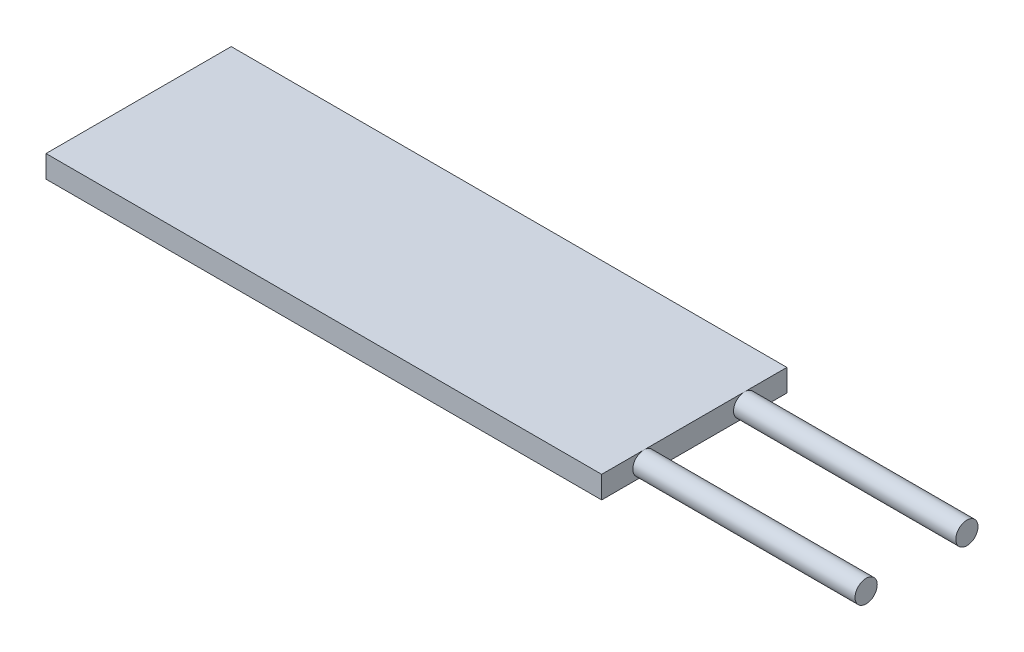
ISO-10303-21;
HEADER;
FILE_DESCRIPTION(('STEP AP214'),'2;1');
FILE_NAME('part.step','',(''),(''),'','','');
FILE_SCHEMA(('AUTOMOTIVE_DESIGN { 1 0 10303 214 1 1 1 1 }'));
ENDSEC;
DATA;
#1=APPLICATION_CONTEXT('core data for automotive mechanical design processes');
#2=APPLICATION_PROTOCOL_DEFINITION('international standard','automotive_design',2000,#1);
#3=PRODUCT_CONTEXT('',#1,'mechanical');
#4=PRODUCT('Part','Part','',(#3));
#5=PRODUCT_RELATED_PRODUCT_CATEGORY('part','',(#4));
#6=PRODUCT_DEFINITION_FORMATION('','',#4);
#7=PRODUCT_DEFINITION_CONTEXT('part definition',#1,'design');
#8=PRODUCT_DEFINITION('design','',#6,#7);
#9=PRODUCT_DEFINITION_SHAPE('','',#8);
#10=(LENGTH_UNIT() NAMED_UNIT(*) SI_UNIT(.MILLI.,.METRE.));
#11=(NAMED_UNIT(*) PLANE_ANGLE_UNIT() SI_UNIT($,.RADIAN.));
#12=(NAMED_UNIT(*) SI_UNIT($,.STERADIAN.) SOLID_ANGLE_UNIT());
#13=UNCERTAINTY_MEASURE_WITH_UNIT(LENGTH_MEASURE(1.E-05),#10,'distance_accuracy_value','');
#14=(GEOMETRIC_REPRESENTATION_CONTEXT(3) GLOBAL_UNCERTAINTY_ASSIGNED_CONTEXT((#13)) GLOBAL_UNIT_ASSIGNED_CONTEXT((#10,
#11,#12)) REPRESENTATION_CONTEXT('',''));
#15=CARTESIAN_POINT('',(0.,0.,0.));
#16=DIRECTION('',(0.,0.,1.));
#17=DIRECTION('',(1.,0.,0.));
#18=AXIS2_PLACEMENT_3D('',#15,#16,#17);
#19=CARTESIAN_POINT('',(75.,0.,0.));
#20=DIRECTION('',(-1.,0.,0.));
#21=DIRECTION('',(0.,0.,1.));
#22=AXIS2_PLACEMENT_3D('',#19,#20,#21);
#23=PLANE('',#22);
#24=CARTESIAN_POINT('',(75.,0.,-6.8));
#25=DIRECTION('',(1.,0.,0.));
#26=DIRECTION('',(0.,0.,1.));
#27=AXIS2_PLACEMENT_3D('',#24,#25,#26);
#28=CIRCLE('',#27,1.5);
#29=CARTESIAN_POINT('',(75.,-1.5,-6.8));
#30=VERTEX_POINT('',#29);
#31=CARTESIAN_POINT('',(75.,1.5,-6.8));
#32=VERTEX_POINT('',#31);
#33=EDGE_CURVE('E105',#30,#32,#28,.T.);
#34=ORIENTED_EDGE('',*,*,#33,.F.);
#35=DIRECTION('',(0.,0.,-1.));
#36=VECTOR('',#35,1.);
#37=CARTESIAN_POINT('',(75.,-1.5,12.5));
#38=LINE('',#37,#36);
#39=CARTESIAN_POINT('',(75.,-1.5,-12.5));
#40=VERTEX_POINT('',#39);
#41=EDGE_CURVE('E92',#30,#40,#38,.T.);
#42=ORIENTED_EDGE('',*,*,#41,.T.);
#43=DIRECTION('',(0.,1.,0.));
#44=VECTOR('',#43,1.);
#45=CARTESIAN_POINT('',(75.,-1.5,-12.5));
#46=LINE('',#45,#44);
#47=CARTESIAN_POINT('',(75.,1.5,-12.5));
#48=VERTEX_POINT('',#47);
#49=EDGE_CURVE('E178',#40,#48,#46,.T.);
#50=ORIENTED_EDGE('',*,*,#49,.T.);
#51=DIRECTION('',(0.,0.,1.));
#52=VECTOR('',#51,1.);
#53=CARTESIAN_POINT('',(75.,1.5,12.5));
#54=LINE('',#53,#52);
#55=EDGE_CURVE('E106',#48,#32,#54,.T.);
#56=ORIENTED_EDGE('',*,*,#55,.T.);
#57=EDGE_LOOP('',(#34,#42,#50,#56));
#58=FACE_BOUND('',#57,.T.);
#59=ADVANCED_FACE('F39',(#58),#23,.F.);
#60=CARTESIAN_POINT('',(75.,0.,6.8));
#61=DIRECTION('',(1.,0.,0.));
#62=DIRECTION('',(0.,0.,-1.));
#63=AXIS2_PLACEMENT_3D('',#60,#61,#62);
#64=CIRCLE('',#63,1.5);
#65=CARTESIAN_POINT('',(75.,1.5,6.8));
#66=VERTEX_POINT('',#65);
#67=CARTESIAN_POINT('',(75.,-1.5,6.8));
#68=VERTEX_POINT('',#67);
#69=EDGE_CURVE('E184',#66,#68,#64,.T.);
#70=ORIENTED_EDGE('',*,*,#69,.F.);
#71=CARTESIAN_POINT('',(75.,1.5,12.5));
#72=VERTEX_POINT('',#71);
#73=EDGE_CURVE('E198',#66,#72,#54,.T.);
#74=ORIENTED_EDGE('',*,*,#73,.T.);
#75=DIRECTION('',(0.,-1.,0.));
#76=VECTOR('',#75,1.);
#77=CARTESIAN_POINT('',(75.,-1.5,12.5));
#78=LINE('',#77,#76);
#79=CARTESIAN_POINT('',(75.,-1.5,12.5));
#80=VERTEX_POINT('',#79);
#81=EDGE_CURVE('E102',#72,#80,#78,.T.);
#82=ORIENTED_EDGE('',*,*,#81,.T.);
#83=EDGE_CURVE('E91',#80,#68,#38,.T.);
#84=ORIENTED_EDGE('',*,*,#83,.T.);
#85=EDGE_LOOP('',(#70,#74,#82,#84));
#86=FACE_BOUND('',#85,.T.);
#87=ADVANCED_FACE('F127',(#86),#23,.F.);
#88=CARTESIAN_POINT('',(75.,-1.5,-12.5));
#89=DIRECTION('',(0.,0.,1.));
#90=DIRECTION('',(1.,0.,0.));
#91=AXIS2_PLACEMENT_3D('',#88,#89,#90);
#92=PLANE('',#91);
#93=DIRECTION('',(0.,1.,0.));
#94=VECTOR('',#93,1.);
#95=CARTESIAN_POINT('',(0.,-1.5,-12.5));
#96=LINE('',#95,#94);
#97=CARTESIAN_POINT('',(0.,-1.5,-12.5));
#98=VERTEX_POINT('',#97);
#99=CARTESIAN_POINT('',(0.,1.5,-12.5));
#100=VERTEX_POINT('',#99);
#101=EDGE_CURVE('E169',#98,#100,#96,.T.);
#102=ORIENTED_EDGE('',*,*,#101,.T.);
#103=DIRECTION('',(-1.,0.,0.));
#104=VECTOR('',#103,1.);
#105=CARTESIAN_POINT('',(75.,1.5,-12.5));
#106=LINE('',#105,#104);
#107=EDGE_CURVE('E164',#48,#100,#106,.T.);
#108=ORIENTED_EDGE('',*,*,#107,.F.);
#109=ORIENTED_EDGE('',*,*,#49,.F.);
#110=DIRECTION('',(-1.,0.,0.));
#111=VECTOR('',#110,1.);
#112=CARTESIAN_POINT('',(75.,-1.5,-12.5));
#113=LINE('',#112,#111);
#114=EDGE_CURVE('E98',#40,#98,#113,.T.);
#115=ORIENTED_EDGE('',*,*,#114,.T.);
#116=EDGE_LOOP('',(#102,#108,#109,#115));
#117=FACE_BOUND('',#116,.T.);
#118=ADVANCED_FACE('F41',(#117),#92,.F.);
#119=CARTESIAN_POINT('',(75.,1.5,12.5));
#120=DIRECTION('',(0.,-1.,0.));
#121=DIRECTION('',(0.,0.,-1.));
#122=AXIS2_PLACEMENT_3D('',#119,#120,#121);
#123=PLANE('',#122);
#124=DIRECTION('',(0.,0.,1.));
#125=VECTOR('',#124,1.);
#126=CARTESIAN_POINT('',(0.,1.5,12.5));
#127=LINE('',#126,#125);
#128=CARTESIAN_POINT('',(0.,1.5,12.5));
#129=VERTEX_POINT('',#128);
#130=EDGE_CURVE('E158',#100,#129,#127,.T.);
#131=ORIENTED_EDGE('',*,*,#130,.T.);
#132=DIRECTION('',(-1.,0.,0.));
#133=VECTOR('',#132,1.);
#134=CARTESIAN_POINT('',(75.,1.5,12.5));
#135=LINE('',#134,#133);
#136=EDGE_CURVE('E161',#72,#129,#135,.T.);
#137=ORIENTED_EDGE('',*,*,#136,.F.);
#138=ORIENTED_EDGE('',*,*,#73,.F.);
#139=EDGE_CURVE('E197',#32,#66,#54,.T.);
#140=ORIENTED_EDGE('',*,*,#139,.F.);
#141=ORIENTED_EDGE('',*,*,#55,.F.);
#142=ORIENTED_EDGE('',*,*,#107,.T.);
#143=EDGE_LOOP('',(#131,#137,#138,#140,#141,#142));
#144=FACE_BOUND('',#143,.T.);
#145=ADVANCED_FACE('F147',(#144),#123,.F.);
#146=CARTESIAN_POINT('',(75.,-1.5,12.5));
#147=DIRECTION('',(0.,0.,-1.));
#148=DIRECTION('',(-1.,0.,0.));
#149=AXIS2_PLACEMENT_3D('',#146,#147,#148);
#150=PLANE('',#149);
#151=DIRECTION('',(0.,-1.,0.));
#152=VECTOR('',#151,1.);
#153=CARTESIAN_POINT('',(0.,-1.5,12.5));
#154=LINE('',#153,#152);
#155=CARTESIAN_POINT('',(0.,-1.5,12.5));
#156=VERTEX_POINT('',#155);
#157=EDGE_CURVE('E168',#129,#156,#154,.T.);
#158=ORIENTED_EDGE('',*,*,#157,.T.);
#159=DIRECTION('',(-1.,0.,0.));
#160=VECTOR('',#159,1.);
#161=CARTESIAN_POINT('',(75.,-1.5,12.5));
#162=LINE('',#161,#160);
#163=EDGE_CURVE('E173',#80,#156,#162,.T.);
#164=ORIENTED_EDGE('',*,*,#163,.F.);
#165=ORIENTED_EDGE('',*,*,#81,.F.);
#166=ORIENTED_EDGE('',*,*,#136,.T.);
#167=EDGE_LOOP('',(#158,#164,#165,#166));
#168=FACE_BOUND('',#167,.T.);
#169=ADVANCED_FACE('F142',(#168),#150,.F.);
#170=CARTESIAN_POINT('',(75.,-1.5,12.5));
#171=DIRECTION('',(0.,1.,0.));
#172=DIRECTION('',(0.,0.,1.));
#173=AXIS2_PLACEMENT_3D('',#170,#171,#172);
#174=PLANE('',#173);
#175=DIRECTION('',(0.,0.,-1.));
#176=VECTOR('',#175,1.);
#177=CARTESIAN_POINT('',(0.,-1.5,12.5));
#178=LINE('',#177,#176);
#179=EDGE_CURVE('E176',#156,#98,#178,.T.);
#180=ORIENTED_EDGE('',*,*,#179,.T.);
#181=ORIENTED_EDGE('',*,*,#114,.F.);
#182=ORIENTED_EDGE('',*,*,#41,.F.);
#183=EDGE_CURVE('E85',#68,#30,#38,.T.);
#184=ORIENTED_EDGE('',*,*,#183,.F.);
#185=ORIENTED_EDGE('',*,*,#83,.F.);
#186=ORIENTED_EDGE('',*,*,#163,.T.);
#187=EDGE_LOOP('',(#180,#181,#182,#184,#185,#186));
#188=FACE_BOUND('',#187,.T.);
#189=ADVANCED_FACE('F96',(#188),#174,.F.);
#190=CARTESIAN_POINT('',(75.,0.,-6.8));
#191=DIRECTION('',(-1.,0.,0.));
#192=DIRECTION('',(0.,0.,1.));
#193=AXIS2_PLACEMENT_3D('',#190,#191,#192);
#194=CIRCLE('',#193,1.5);
#195=EDGE_CURVE('E11',#32,#30,#194,.F.);
#196=ORIENTED_EDGE('',*,*,#195,.F.);
#197=ORIENTED_EDGE('',*,*,#139,.T.);
#198=EDGE_CURVE('E47',#68,#66,#64,.T.);
#199=ORIENTED_EDGE('',*,*,#198,.F.);
#200=ORIENTED_EDGE('',*,*,#183,.T.);
#201=EDGE_LOOP('',(#196,#197,#199,#200));
#202=FACE_BOUND('',#201,.T.);
#203=ADVANCED_FACE('F87',(#202),#23,.F.);
#204=CARTESIAN_POINT('',(0.,0.,0.));
#205=DIRECTION('',(-1.,0.,0.));
#206=DIRECTION('',(0.,0.,1.));
#207=AXIS2_PLACEMENT_3D('',#204,#205,#206);
#208=PLANE('',#207);
#209=ORIENTED_EDGE('',*,*,#101,.F.);
#210=ORIENTED_EDGE('',*,*,#179,.F.);
#211=ORIENTED_EDGE('',*,*,#157,.F.);
#212=ORIENTED_EDGE('',*,*,#130,.F.);
#213=EDGE_LOOP('',(#209,#210,#211,#212));
#214=FACE_BOUND('',#213,.T.);
#215=ADVANCED_FACE('F136',(#214),#208,.T.);
#216=CARTESIAN_POINT('',(105.,0.,6.8));
#217=DIRECTION('',(-1.,0.,0.));
#218=DIRECTION('',(0.,0.,1.));
#219=AXIS2_PLACEMENT_3D('',#216,#217,#218);
#220=CYLINDRICAL_SURFACE('',#219,1.5);
#221=CARTESIAN_POINT('',(105.,0.,6.8));
#222=DIRECTION('',(1.,0.,0.));
#223=DIRECTION('',(0.,0.,-1.));
#224=AXIS2_PLACEMENT_3D('',#221,#222,#223);
#225=CIRCLE('',#224,1.5);
#226=CARTESIAN_POINT('',(105.,0.,5.3));
#227=VERTEX_POINT('',#226);
#228=EDGE_CURVE('E189',#227,#227,#225,.T.);
#229=ORIENTED_EDGE('',*,*,#228,.F.);
#230=EDGE_LOOP('',(#229));
#231=FACE_BOUND('',#230,.T.);
#232=ORIENTED_EDGE('',*,*,#69,.T.);
#233=ORIENTED_EDGE('',*,*,#198,.T.);
#234=EDGE_LOOP('',(#232,#233));
#235=FACE_BOUND('',#234,.T.);
#236=ADVANCED_FACE('F122',(#231,#235),#220,.T.);
#237=CARTESIAN_POINT('',(105.,0.,6.8));
#238=DIRECTION('',(1.,0.,0.));
#239=DIRECTION('',(0.,0.,-1.));
#240=AXIS2_PLACEMENT_3D('',#237,#238,#239);
#241=PLANE('',#240);
#242=ORIENTED_EDGE('',*,*,#228,.T.);
#243=EDGE_LOOP('',(#242));
#244=FACE_BOUND('',#243,.T.);
#245=ADVANCED_FACE('F113',(#244),#241,.T.);
#246=CARTESIAN_POINT('',(105.,0.,-6.8));
#247=DIRECTION('',(-1.,0.,0.));
#248=DIRECTION('',(0.,0.,1.));
#249=AXIS2_PLACEMENT_3D('',#246,#247,#248);
#250=CYLINDRICAL_SURFACE('',#249,1.5);
#251=CARTESIAN_POINT('',(105.,0.,-6.8));
#252=DIRECTION('',(1.,0.,0.));
#253=DIRECTION('',(0.,0.,1.));
#254=AXIS2_PLACEMENT_3D('',#251,#252,#253);
#255=CIRCLE('',#254,1.5);
#256=CARTESIAN_POINT('',(105.,0.,-5.3));
#257=VERTEX_POINT('',#256);
#258=EDGE_CURVE('E108',#257,#257,#255,.T.);
#259=ORIENTED_EDGE('',*,*,#258,.F.);
#260=EDGE_LOOP('',(#259));
#261=FACE_BOUND('',#260,.T.);
#262=ORIENTED_EDGE('',*,*,#33,.T.);
#263=ORIENTED_EDGE('',*,*,#195,.T.);
#264=EDGE_LOOP('',(#262,#263));
#265=FACE_BOUND('',#264,.T.);
#266=ADVANCED_FACE('F110',(#261,#265),#250,.T.);
#267=CARTESIAN_POINT('',(105.,0.,-6.8));
#268=DIRECTION('',(-1.,0.,0.));
#269=DIRECTION('',(0.,0.,1.));
#270=AXIS2_PLACEMENT_3D('',#267,#268,#269);
#271=PLANE('',#270);
#272=ORIENTED_EDGE('',*,*,#258,.T.);
#273=EDGE_LOOP('',(#272));
#274=FACE_BOUND('',#273,.T.);
#275=ADVANCED_FACE('F112',(#274),#271,.F.);
#276=CLOSED_SHELL('',(#59,#87,#118,#145,#169,#189,#203,#215,#236,#245,#266,#275));
#277=MANIFOLD_SOLID_BREP('B2',#276);
#278=ADVANCED_BREP_SHAPE_REPRESENTATION('',(#18,#277),#14);
#279=SHAPE_DEFINITION_REPRESENTATION(#9,#278);
ENDSEC;
END-ISO-10303-21;
